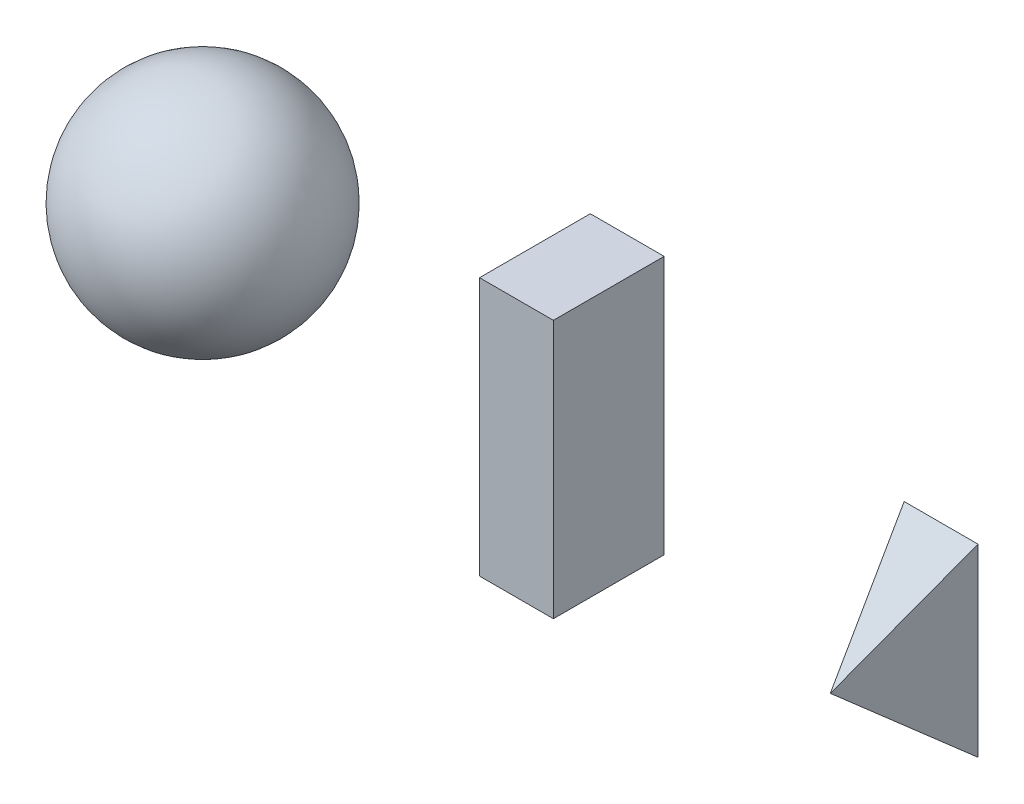
ISO-10303-21;
HEADER;
FILE_DESCRIPTION(('STEP AP214'),'2;1');
FILE_NAME('part.step','',(''),(''),'','','');
FILE_SCHEMA(('AUTOMOTIVE_DESIGN { 1 0 10303 214 1 1 1 1 }'));
ENDSEC;
DATA;
#1=APPLICATION_CONTEXT('core data for automotive mechanical design processes');
#2=APPLICATION_PROTOCOL_DEFINITION('international standard','automotive_design',2000,#1);
#3=PRODUCT_CONTEXT('',#1,'mechanical');
#4=PRODUCT('Part','Part','',(#3));
#5=PRODUCT_RELATED_PRODUCT_CATEGORY('part','',(#4));
#6=PRODUCT_DEFINITION_FORMATION('','',#4);
#7=PRODUCT_DEFINITION_CONTEXT('part definition',#1,'design');
#8=PRODUCT_DEFINITION('design','',#6,#7);
#9=PRODUCT_DEFINITION_SHAPE('','',#8);
#10=(LENGTH_UNIT() NAMED_UNIT(*) SI_UNIT(.MILLI.,.METRE.));
#11=(NAMED_UNIT(*) PLANE_ANGLE_UNIT() SI_UNIT($,.RADIAN.));
#12=(NAMED_UNIT(*) SI_UNIT($,.STERADIAN.) SOLID_ANGLE_UNIT());
#13=UNCERTAINTY_MEASURE_WITH_UNIT(LENGTH_MEASURE(1.E-05),#10,'distance_accuracy_value','');
#14=(GEOMETRIC_REPRESENTATION_CONTEXT(3) GLOBAL_UNCERTAINTY_ASSIGNED_CONTEXT((#13)) GLOBAL_UNIT_ASSIGNED_CONTEXT((#10,
#11,#12)) REPRESENTATION_CONTEXT('',''));
#15=CARTESIAN_POINT('',(0.,0.,0.));
#16=DIRECTION('',(0.,0.,1.));
#17=DIRECTION('',(1.,0.,0.));
#18=AXIS2_PLACEMENT_3D('',#15,#16,#17);
#19=CARTESIAN_POINT('',(-254.,0.,0.));
#20=DIRECTION('',(0.,1.,0.));
#21=DIRECTION('',(-1.,0.,0.));
#22=AXIS2_PLACEMENT_3D('',#19,#20,#21);
#23=SPHERICAL_SURFACE('',#22,76.2);
#24=CARTESIAN_POINT('',(-254.,76.2,0.));
#25=VERTEX_POINT('',#24);
#26=VERTEX_LOOP('',#25);
#27=FACE_BOUND('',#26,.T.);
#28=ADVANCED_FACE('F48',(#27),#23,.T.);
#29=CLOSED_SHELL('',(#28));
#30=MANIFOLD_SOLID_BREP('B2',#29);
#31=CARTESIAN_POINT('',(279.4,-88.9,0.));
#32=DIRECTION('',(0.948683298050514,0.,0.316227766016838));
#33=DIRECTION('',(0.316227766016838,0.,-0.948683298050514));
#34=AXIS2_PLACEMENT_3D('',#31,#32,#33);
#35=PLANE('',#34);
#36=DIRECTION('',(-0.248069469178417,-0.620173672946043,0.74420840753525));
#37=VECTOR('',#36,1.);
#38=CARTESIAN_POINT('',(255.953846153846,4.88461538461531,70.3384615384616));
#39=LINE('',#38,#37);
#40=CARTESIAN_POINT('',(279.4,63.5000000000001,0.));
#41=VERTEX_POINT('',#40);
#42=CARTESIAN_POINT('',(254.,0.,76.2));
#43=VERTEX_POINT('',#42);
#44=EDGE_CURVE('E112',#41,#43,#39,.T.);
#45=ORIENTED_EDGE('',*,*,#44,.T.);
#46=DIRECTION('',(0.248069469178417,-0.620173672946042,-0.744208407535251));
#47=VECTOR('',#46,1.);
#48=CARTESIAN_POINT('',(283.307692307692,-73.2692307692307,-11.723076923077));
#49=LINE('',#48,#47);
#50=CARTESIAN_POINT('',(279.4,-63.4999999999999,0.));
#51=VERTEX_POINT('',#50);
#52=EDGE_CURVE('E93',#43,#51,#49,.T.);
#53=ORIENTED_EDGE('',*,*,#52,.T.);
#54=DIRECTION('',(0.,1.,0.));
#55=VECTOR('',#54,1.);
#56=CARTESIAN_POINT('',(279.4,-63.4999999999999,0.));
#57=LINE('',#56,#55);
#58=EDGE_CURVE('E111',#51,#41,#57,.T.);
#59=ORIENTED_EDGE('',*,*,#58,.T.);
#60=EDGE_LOOP('',(#45,#53,#59));
#61=FACE_BOUND('',#60,.T.);
#62=ADVANCED_FACE('F70',(#61),#35,.T.);
#63=CARTESIAN_POINT('',(254.,-88.9,76.2));
#64=DIRECTION('',(-0.948683298050514,0.,0.316227766016838));
#65=DIRECTION('',(0.316227766016838,0.,0.948683298050514));
#66=AXIS2_PLACEMENT_3D('',#63,#64,#65);
#67=PLANE('',#66);
#68=DIRECTION('',(0.,-1.,0.));
#69=VECTOR('',#68,1.);
#70=CARTESIAN_POINT('',(228.6,-63.4999999999999,0.));
#71=LINE('',#70,#69);
#72=CARTESIAN_POINT('',(228.6,63.5000000000001,0.));
#73=VERTEX_POINT('',#72);
#74=CARTESIAN_POINT('',(228.6,-63.4999999999999,0.));
#75=VERTEX_POINT('',#74);
#76=EDGE_CURVE('E106',#73,#75,#71,.T.);
#77=ORIENTED_EDGE('',*,*,#76,.T.);
#78=DIRECTION('',(0.248069469178417,0.620173672946042,0.744208407535251));
#79=VECTOR('',#78,1.);
#80=CARTESIAN_POINT('',(240.323076923077,-34.1923076923076,35.1692307692308));
#81=LINE('',#80,#79);
#82=EDGE_CURVE('E46',#75,#43,#81,.T.);
#83=ORIENTED_EDGE('',*,*,#82,.T.);
#84=DIRECTION('',(-0.248069469178417,0.620173672946043,-0.74420840753525));
#85=VECTOR('',#84,1.);
#86=CARTESIAN_POINT('',(267.676923076923,-34.1923076923078,117.230769230769));
#87=LINE('',#86,#85);
#88=EDGE_CURVE('E78',#43,#73,#87,.T.);
#89=ORIENTED_EDGE('',*,*,#88,.T.);
#90=EDGE_LOOP('',(#77,#83,#89));
#91=FACE_BOUND('',#90,.T.);
#92=ADVANCED_FACE('F119',(#91),#67,.T.);
#93=CARTESIAN_POINT('',(0.,0.,0.));
#94=DIRECTION('',(0.,0.,-1.));
#95=DIRECTION('',(-1.,0.,0.));
#96=AXIS2_PLACEMENT_3D('',#93,#94,#95);
#97=PLANE('',#96);
#98=ORIENTED_EDGE('',*,*,#58,.F.);
#99=DIRECTION('',(1.,0.,0.));
#100=VECTOR('',#99,1.);
#101=CARTESIAN_POINT('',(228.6,-63.4999999999999,0.));
#102=LINE('',#101,#100);
#103=EDGE_CURVE('E100',#75,#51,#102,.T.);
#104=ORIENTED_EDGE('',*,*,#103,.F.);
#105=ORIENTED_EDGE('',*,*,#76,.F.);
#106=DIRECTION('',(-1.,0.,0.));
#107=VECTOR('',#106,1.);
#108=CARTESIAN_POINT('',(228.6,63.5000000000001,0.));
#109=LINE('',#108,#107);
#110=EDGE_CURVE('E85',#41,#73,#109,.T.);
#111=ORIENTED_EDGE('',*,*,#110,.F.);
#112=EDGE_LOOP('',(#98,#104,#105,#111));
#113=FACE_BOUND('',#112,.T.);
#114=ADVANCED_FACE('F72',(#113),#97,.T.);
#115=CARTESIAN_POINT('',(-25.4,0.,76.2));
#116=DIRECTION('',(0.,0.768221279597375,0.640184399664481));
#117=DIRECTION('',(0.,-0.640184399664481,0.768221279597375));
#118=AXIS2_PLACEMENT_3D('',#115,#116,#117);
#119=PLANE('',#118);
#120=ORIENTED_EDGE('',*,*,#110,.T.);
#121=ORIENTED_EDGE('',*,*,#88,.F.);
#122=ORIENTED_EDGE('',*,*,#44,.F.);
#123=EDGE_LOOP('',(#120,#121,#122));
#124=FACE_BOUND('',#123,.T.);
#125=ADVANCED_FACE('F120',(#124),#119,.T.);
#126=CARTESIAN_POINT('',(-25.4,-63.4999999999999,0.));
#127=DIRECTION('',(0.,-0.768221279597376,0.640184399664479));
#128=DIRECTION('',(0.,-0.640184399664479,-0.768221279597377));
#129=AXIS2_PLACEMENT_3D('',#126,#127,#128);
#130=PLANE('',#129);
#131=ORIENTED_EDGE('',*,*,#82,.F.);
#132=ORIENTED_EDGE('',*,*,#103,.T.);
#133=ORIENTED_EDGE('',*,*,#52,.F.);
#134=EDGE_LOOP('',(#131,#132,#133));
#135=FACE_BOUND('',#134,.T.);
#136=ADVANCED_FACE('F101',(#135),#130,.T.);
#137=CLOSED_SHELL('',(#62,#92,#114,#125,#136));
#138=MANIFOLD_SOLID_BREP('B7',#137);
#139=CARTESIAN_POINT('',(25.4,-88.9,38.1));
#140=DIRECTION('',(-1.,0.,0.));
#141=DIRECTION('',(0.,0.,1.));
#142=AXIS2_PLACEMENT_3D('',#139,#140,#141);
#143=PLANE('',#142);
#144=DIRECTION('',(0.,1.,0.));
#145=VECTOR('',#144,1.);
#146=CARTESIAN_POINT('',(25.4,-88.9,-38.1));
#147=LINE('',#146,#145);
#148=CARTESIAN_POINT('',(25.4,-88.9,-38.1));
#149=VERTEX_POINT('',#148);
#150=CARTESIAN_POINT('',(25.4,88.9,-38.1));
#151=VERTEX_POINT('',#150);
#152=EDGE_CURVE('E225',#149,#151,#147,.T.);
#153=ORIENTED_EDGE('',*,*,#152,.T.);
#154=DIRECTION('',(0.,0.,-1.));
#155=VECTOR('',#154,1.);
#156=CARTESIAN_POINT('',(25.4,88.9,38.1));
#157=LINE('',#156,#155);
#158=CARTESIAN_POINT('',(25.4,88.9,38.1));
#159=VERTEX_POINT('',#158);
#160=EDGE_CURVE('E68',#159,#151,#157,.T.);
#161=ORIENTED_EDGE('',*,*,#160,.F.);
#162=DIRECTION('',(0.,1.,0.));
#163=VECTOR('',#162,1.);
#164=CARTESIAN_POINT('',(25.4,-88.9,38.1));
#165=LINE('',#164,#163);
#166=CARTESIAN_POINT('',(25.4,-88.9,38.1));
#167=VERTEX_POINT('',#166);
#168=EDGE_CURVE('E213',#167,#159,#165,.T.);
#169=ORIENTED_EDGE('',*,*,#168,.F.);
#170=DIRECTION('',(0.,0.,-1.));
#171=VECTOR('',#170,1.);
#172=CARTESIAN_POINT('',(25.4,-88.9,38.1));
#173=LINE('',#172,#171);
#174=EDGE_CURVE('E221',#167,#149,#173,.T.);
#175=ORIENTED_EDGE('',*,*,#174,.T.);
#176=EDGE_LOOP('',(#153,#161,#169,#175));
#177=FACE_BOUND('',#176,.T.);
#178=ADVANCED_FACE('F162',(#177),#143,.F.);
#179=CARTESIAN_POINT('',(-25.4,88.9,38.1));
#180=DIRECTION('',(0.,-1.,0.));
#181=DIRECTION('',(0.,0.,-1.));
#182=AXIS2_PLACEMENT_3D('',#179,#180,#181);
#183=PLANE('',#182);
#184=DIRECTION('',(-1.,0.,0.));
#185=VECTOR('',#184,1.);
#186=CARTESIAN_POINT('',(-25.4,88.9,-38.1));
#187=LINE('',#186,#185);
#188=CARTESIAN_POINT('',(-25.4,88.9,-38.1));
#189=VERTEX_POINT('',#188);
#190=EDGE_CURVE('E217',#151,#189,#187,.T.);
#191=ORIENTED_EDGE('',*,*,#190,.T.);
#192=DIRECTION('',(0.,0.,-1.));
#193=VECTOR('',#192,1.);
#194=CARTESIAN_POINT('',(-25.4,88.9,38.1));
#195=LINE('',#194,#193);
#196=CARTESIAN_POINT('',(-25.4,88.9,38.1));
#197=VERTEX_POINT('',#196);
#198=EDGE_CURVE('E170',#197,#189,#195,.T.);
#199=ORIENTED_EDGE('',*,*,#198,.F.);
#200=DIRECTION('',(-1.,0.,0.));
#201=VECTOR('',#200,1.);
#202=CARTESIAN_POINT('',(-25.4,88.9,38.1));
#203=LINE('',#202,#201);
#204=EDGE_CURVE('E208',#159,#197,#203,.T.);
#205=ORIENTED_EDGE('',*,*,#204,.F.);
#206=ORIENTED_EDGE('',*,*,#160,.T.);
#207=EDGE_LOOP('',(#191,#199,#205,#206));
#208=FACE_BOUND('',#207,.T.);
#209=ADVANCED_FACE('F216',(#208),#183,.F.);
#210=CARTESIAN_POINT('',(-25.4,-88.9,38.1));
#211=DIRECTION('',(1.,0.,0.));
#212=DIRECTION('',(0.,0.,-1.));
#213=AXIS2_PLACEMENT_3D('',#210,#211,#212);
#214=PLANE('',#213);
#215=DIRECTION('',(0.,-1.,0.));
#216=VECTOR('',#215,1.);
#217=CARTESIAN_POINT('',(-25.4,-88.9,-38.1));
#218=LINE('',#217,#216);
#219=CARTESIAN_POINT('',(-25.4,-88.9,-38.1));
#220=VERTEX_POINT('',#219);
#221=EDGE_CURVE('E195',#189,#220,#218,.T.);
#222=ORIENTED_EDGE('',*,*,#221,.T.);
#223=DIRECTION('',(0.,0.,-1.));
#224=VECTOR('',#223,1.);
#225=CARTESIAN_POINT('',(-25.4,-88.9,38.1));
#226=LINE('',#225,#224);
#227=CARTESIAN_POINT('',(-25.4,-88.9,38.1));
#228=VERTEX_POINT('',#227);
#229=EDGE_CURVE('E218',#228,#220,#226,.T.);
#230=ORIENTED_EDGE('',*,*,#229,.F.);
#231=DIRECTION('',(0.,-1.,0.));
#232=VECTOR('',#231,1.);
#233=CARTESIAN_POINT('',(-25.4,-88.9,38.1));
#234=LINE('',#233,#232);
#235=EDGE_CURVE('E211',#197,#228,#234,.T.);
#236=ORIENTED_EDGE('',*,*,#235,.F.);
#237=ORIENTED_EDGE('',*,*,#198,.T.);
#238=EDGE_LOOP('',(#222,#230,#236,#237));
#239=FACE_BOUND('',#238,.T.);
#240=ADVANCED_FACE('F219',(#239),#214,.F.);
#241=CARTESIAN_POINT('',(-25.4,-88.9,38.1));
#242=DIRECTION('',(0.,1.,0.));
#243=DIRECTION('',(0.,0.,1.));
#244=AXIS2_PLACEMENT_3D('',#241,#242,#243);
#245=PLANE('',#244);
#246=DIRECTION('',(1.,0.,0.));
#247=VECTOR('',#246,1.);
#248=CARTESIAN_POINT('',(-25.4,-88.9,-38.1));
#249=LINE('',#248,#247);
#250=EDGE_CURVE('E201',#220,#149,#249,.T.);
#251=ORIENTED_EDGE('',*,*,#250,.T.);
#252=ORIENTED_EDGE('',*,*,#174,.F.);
#253=DIRECTION('',(1.,0.,0.));
#254=VECTOR('',#253,1.);
#255=CARTESIAN_POINT('',(-25.4,-88.9,38.1));
#256=LINE('',#255,#254);
#257=EDGE_CURVE('E178',#228,#167,#256,.T.);
#258=ORIENTED_EDGE('',*,*,#257,.F.);
#259=ORIENTED_EDGE('',*,*,#229,.T.);
#260=EDGE_LOOP('',(#251,#252,#258,#259));
#261=FACE_BOUND('',#260,.T.);
#262=ADVANCED_FACE('F232',(#261),#245,.F.);
#263=CARTESIAN_POINT('',(0.,0.,38.1));
#264=DIRECTION('',(0.,0.,-1.));
#265=DIRECTION('',(-1.,0.,0.));
#266=AXIS2_PLACEMENT_3D('',#263,#264,#265);
#267=PLANE('',#266);
#268=ORIENTED_EDGE('',*,*,#168,.T.);
#269=ORIENTED_EDGE('',*,*,#204,.T.);
#270=ORIENTED_EDGE('',*,*,#235,.T.);
#271=ORIENTED_EDGE('',*,*,#257,.T.);
#272=EDGE_LOOP('',(#268,#269,#270,#271));
#273=FACE_BOUND('',#272,.T.);
#274=ADVANCED_FACE('F209',(#273),#267,.F.);
#275=CARTESIAN_POINT('',(0.,0.,-38.1));
#276=DIRECTION('',(0.,0.,-1.));
#277=DIRECTION('',(-1.,0.,0.));
#278=AXIS2_PLACEMENT_3D('',#275,#276,#277);
#279=PLANE('',#278);
#280=ORIENTED_EDGE('',*,*,#152,.F.);
#281=ORIENTED_EDGE('',*,*,#250,.F.);
#282=ORIENTED_EDGE('',*,*,#221,.F.);
#283=ORIENTED_EDGE('',*,*,#190,.F.);
#284=EDGE_LOOP('',(#280,#281,#282,#283));
#285=FACE_BOUND('',#284,.T.);
#286=ADVANCED_FACE('F235',(#285),#279,.T.);
#287=CLOSED_SHELL('',(#178,#209,#240,#262,#274,#286));
#288=MANIFOLD_SOLID_BREP('B40',#287);
#289=ADVANCED_BREP_SHAPE_REPRESENTATION('',(#18,#30,#138,#288),#14);
#290=SHAPE_DEFINITION_REPRESENTATION(#9,#289);
ENDSEC;
END-ISO-10303-21;
